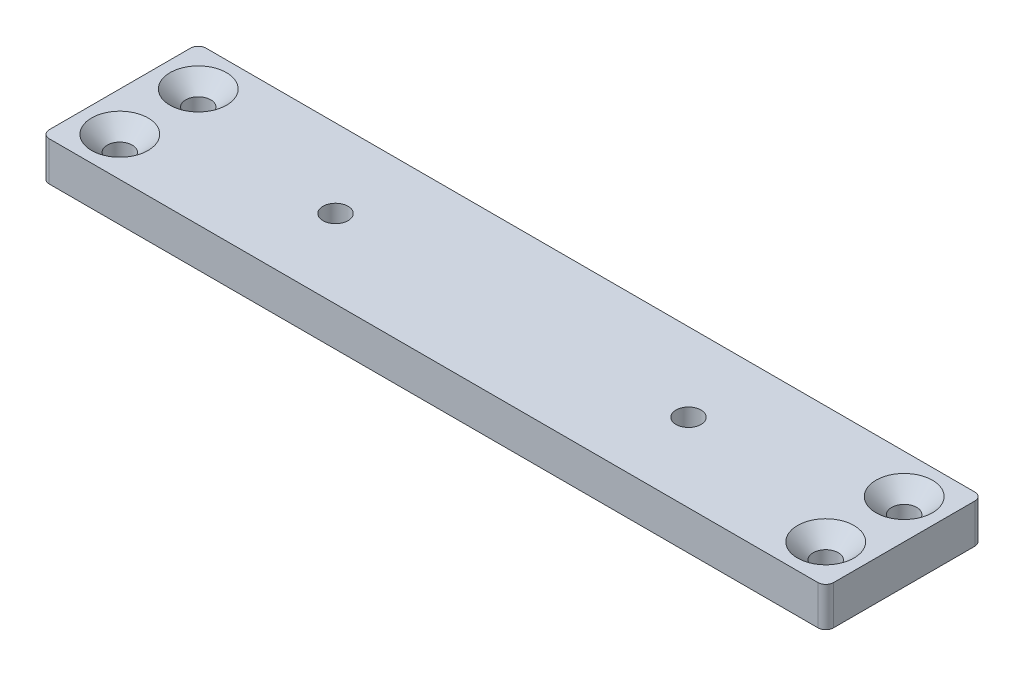
ISO-10303-21;
HEADER;
FILE_DESCRIPTION(('STEP AP214'),'2;1');
FILE_NAME('part.step','',(''),(''),'','','');
FILE_SCHEMA(('AUTOMOTIVE_DESIGN { 1 0 10303 214 1 1 1 1 }'));
ENDSEC;
DATA;
#1=APPLICATION_CONTEXT('core data for automotive mechanical design processes');
#2=APPLICATION_PROTOCOL_DEFINITION('international standard','automotive_design',2000,#1);
#3=PRODUCT_CONTEXT('',#1,'mechanical');
#4=PRODUCT('Part','Part','',(#3));
#5=PRODUCT_RELATED_PRODUCT_CATEGORY('part','',(#4));
#6=PRODUCT_DEFINITION_FORMATION('','',#4);
#7=PRODUCT_DEFINITION_CONTEXT('part definition',#1,'design');
#8=PRODUCT_DEFINITION('design','',#6,#7);
#9=PRODUCT_DEFINITION_SHAPE('','',#8);
#10=(LENGTH_UNIT() NAMED_UNIT(*) SI_UNIT(.MILLI.,.METRE.));
#11=(NAMED_UNIT(*) PLANE_ANGLE_UNIT() SI_UNIT($,.RADIAN.));
#12=(NAMED_UNIT(*) SI_UNIT($,.STERADIAN.) SOLID_ANGLE_UNIT());
#13=UNCERTAINTY_MEASURE_WITH_UNIT(LENGTH_MEASURE(1.E-05),#10,'distance_accuracy_value','');
#14=(GEOMETRIC_REPRESENTATION_CONTEXT(3) GLOBAL_UNCERTAINTY_ASSIGNED_CONTEXT((#13)) GLOBAL_UNIT_ASSIGNED_CONTEXT((#10,
#11,#12)) REPRESENTATION_CONTEXT('',''));
#15=CARTESIAN_POINT('',(0.,0.,0.));
#16=DIRECTION('',(0.,0.,1.));
#17=DIRECTION('',(1.,0.,0.));
#18=AXIS2_PLACEMENT_3D('',#15,#16,#17);
#19=CARTESIAN_POINT('',(-50.,0.,20.));
#20=DIRECTION('',(0.,0.,1.));
#21=DIRECTION('',(1.,0.,0.));
#22=AXIS2_PLACEMENT_3D('',#19,#20,#21);
#23=PLANE('',#22);
#24=DIRECTION('',(1.,0.,0.));
#25=VECTOR('',#24,1.);
#26=CARTESIAN_POINT('',(-50.,5.,20.));
#27=LINE('',#26,#25);
#28=CARTESIAN_POINT('',(-49.,5.,20.));
#29=VERTEX_POINT('',#28);
#30=CARTESIAN_POINT('',(49.,5.,20.));
#31=VERTEX_POINT('',#30);
#32=EDGE_CURVE('E113',#29,#31,#27,.T.);
#33=ORIENTED_EDGE('',*,*,#32,.F.);
#34=DIRECTION('',(0.,1.,0.));
#35=VECTOR('',#34,1.);
#36=CARTESIAN_POINT('',(-49.,0.,20.));
#37=LINE('',#36,#35);
#38=CARTESIAN_POINT('',(-49.,0.,20.));
#39=VERTEX_POINT('',#38);
#40=EDGE_CURVE('E182',#29,#39,#37,.F.);
#41=ORIENTED_EDGE('',*,*,#40,.T.);
#42=DIRECTION('',(1.,0.,0.));
#43=VECTOR('',#42,1.);
#44=CARTESIAN_POINT('',(-50.,0.,20.));
#45=LINE('',#44,#43);
#46=CARTESIAN_POINT('',(49.,0.,20.));
#47=VERTEX_POINT('',#46);
#48=EDGE_CURVE('E278',#39,#47,#45,.T.);
#49=ORIENTED_EDGE('',*,*,#48,.T.);
#50=DIRECTION('',(0.,1.,0.));
#51=VECTOR('',#50,1.);
#52=CARTESIAN_POINT('',(49.,0.,20.));
#53=LINE('',#52,#51);
#54=EDGE_CURVE('E179',#47,#31,#53,.T.);
#55=ORIENTED_EDGE('',*,*,#54,.T.);
#56=EDGE_LOOP('',(#33,#41,#49,#55));
#57=FACE_BOUND('',#56,.T.);
#58=ADVANCED_FACE('F40',(#57),#23,.T.);
#59=CARTESIAN_POINT('',(-50.,0.,0.));
#60=DIRECTION('',(-1.,0.,0.));
#61=DIRECTION('',(0.,0.,1.));
#62=AXIS2_PLACEMENT_3D('',#59,#60,#61);
#63=PLANE('',#62);
#64=DIRECTION('',(0.,0.,1.));
#65=VECTOR('',#64,1.);
#66=CARTESIAN_POINT('',(-50.,0.,0.));
#67=LINE('',#66,#65);
#68=CARTESIAN_POINT('',(-50.,0.,1.));
#69=VERTEX_POINT('',#68);
#70=CARTESIAN_POINT('',(-50.,0.,19.));
#71=VERTEX_POINT('',#70);
#72=EDGE_CURVE('E137',#69,#71,#67,.T.);
#73=ORIENTED_EDGE('',*,*,#72,.T.);
#74=DIRECTION('',(0.,1.,0.));
#75=VECTOR('',#74,1.);
#76=CARTESIAN_POINT('',(-50.,0.,19.));
#77=LINE('',#76,#75);
#78=CARTESIAN_POINT('',(-50.,5.,19.));
#79=VERTEX_POINT('',#78);
#80=EDGE_CURVE('E175',#71,#79,#77,.T.);
#81=ORIENTED_EDGE('',*,*,#80,.T.);
#82=DIRECTION('',(0.,0.,1.));
#83=VECTOR('',#82,1.);
#84=CARTESIAN_POINT('',(-50.,5.,0.));
#85=LINE('',#84,#83);
#86=CARTESIAN_POINT('',(-50.,5.,1.));
#87=VERTEX_POINT('',#86);
#88=EDGE_CURVE('E146',#87,#79,#85,.T.);
#89=ORIENTED_EDGE('',*,*,#88,.F.);
#90=DIRECTION('',(0.,1.,0.));
#91=VECTOR('',#90,1.);
#92=CARTESIAN_POINT('',(-50.,0.,1.));
#93=LINE('',#92,#91);
#94=EDGE_CURVE('E63',#87,#69,#93,.F.);
#95=ORIENTED_EDGE('',*,*,#94,.T.);
#96=EDGE_LOOP('',(#73,#81,#89,#95));
#97=FACE_BOUND('',#96,.T.);
#98=ADVANCED_FACE('F319',(#97),#63,.T.);
#99=CARTESIAN_POINT('',(50.,0.,0.));
#100=DIRECTION('',(0.,0.,-1.));
#101=DIRECTION('',(-1.,0.,0.));
#102=AXIS2_PLACEMENT_3D('',#99,#100,#101);
#103=PLANE('',#102);
#104=DIRECTION('',(-1.,0.,0.));
#105=VECTOR('',#104,1.);
#106=CARTESIAN_POINT('',(50.,5.,0.));
#107=LINE('',#106,#105);
#108=CARTESIAN_POINT('',(49.,5.,0.));
#109=VERTEX_POINT('',#108);
#110=CARTESIAN_POINT('',(-49.,5.,0.));
#111=VERTEX_POINT('',#110);
#112=EDGE_CURVE('E131',#109,#111,#107,.T.);
#113=ORIENTED_EDGE('',*,*,#112,.F.);
#114=DIRECTION('',(0.,1.,0.));
#115=VECTOR('',#114,1.);
#116=CARTESIAN_POINT('',(49.,0.,0.));
#117=LINE('',#116,#115);
#118=CARTESIAN_POINT('',(49.,0.,0.));
#119=VERTEX_POINT('',#118);
#120=EDGE_CURVE('E160',#109,#119,#117,.F.);
#121=ORIENTED_EDGE('',*,*,#120,.T.);
#122=DIRECTION('',(-1.,0.,0.));
#123=VECTOR('',#122,1.);
#124=CARTESIAN_POINT('',(50.,0.,0.));
#125=LINE('',#124,#123);
#126=CARTESIAN_POINT('',(-49.,0.,0.));
#127=VERTEX_POINT('',#126);
#128=EDGE_CURVE('E143',#119,#127,#125,.T.);
#129=ORIENTED_EDGE('',*,*,#128,.T.);
#130=DIRECTION('',(0.,1.,0.));
#131=VECTOR('',#130,1.);
#132=CARTESIAN_POINT('',(-49.,0.,0.));
#133=LINE('',#132,#131);
#134=EDGE_CURVE('E156',#127,#111,#133,.T.);
#135=ORIENTED_EDGE('',*,*,#134,.T.);
#136=EDGE_LOOP('',(#113,#121,#129,#135));
#137=FACE_BOUND('',#136,.T.);
#138=ADVANCED_FACE('F273',(#137),#103,.T.);
#139=CARTESIAN_POINT('',(50.,0.,20.));
#140=DIRECTION('',(1.,0.,0.));
#141=DIRECTION('',(0.,0.,-1.));
#142=AXIS2_PLACEMENT_3D('',#139,#140,#141);
#143=PLANE('',#142);
#144=DIRECTION('',(0.,0.,-1.));
#145=VECTOR('',#144,1.);
#146=CARTESIAN_POINT('',(50.,0.,20.));
#147=LINE('',#146,#145);
#148=CARTESIAN_POINT('',(50.,0.,19.));
#149=VERTEX_POINT('',#148);
#150=CARTESIAN_POINT('',(50.,0.,1.));
#151=VERTEX_POINT('',#150);
#152=EDGE_CURVE('E266',#149,#151,#147,.T.);
#153=ORIENTED_EDGE('',*,*,#152,.T.);
#154=DIRECTION('',(0.,1.,0.));
#155=VECTOR('',#154,1.);
#156=CARTESIAN_POINT('',(50.,0.,1.));
#157=LINE('',#156,#155);
#158=CARTESIAN_POINT('',(50.,5.,1.));
#159=VERTEX_POINT('',#158);
#160=EDGE_CURVE('E129',#151,#159,#157,.T.);
#161=ORIENTED_EDGE('',*,*,#160,.T.);
#162=DIRECTION('',(0.,0.,-1.));
#163=VECTOR('',#162,1.);
#164=CARTESIAN_POINT('',(50.,5.,20.));
#165=LINE('',#164,#163);
#166=CARTESIAN_POINT('',(50.,5.,19.));
#167=VERTEX_POINT('',#166);
#168=EDGE_CURVE('E111',#167,#159,#165,.T.);
#169=ORIENTED_EDGE('',*,*,#168,.F.);
#170=DIRECTION('',(0.,1.,0.));
#171=VECTOR('',#170,1.);
#172=CARTESIAN_POINT('',(50.,0.,19.));
#173=LINE('',#172,#171);
#174=EDGE_CURVE('E126',#167,#149,#173,.F.);
#175=ORIENTED_EDGE('',*,*,#174,.T.);
#176=EDGE_LOOP('',(#153,#161,#169,#175));
#177=FACE_BOUND('',#176,.T.);
#178=ADVANCED_FACE('F125',(#177),#143,.T.);
#179=CARTESIAN_POINT('',(0.,0.,0.));
#180=DIRECTION('',(0.,1.,0.));
#181=DIRECTION('',(0.,0.,1.));
#182=AXIS2_PLACEMENT_3D('',#179,#180,#181);
#183=PLANE('',#182);
#184=CARTESIAN_POINT('',(22.5,0.,9.99999999999999));
#185=DIRECTION('',(0.,1.,0.));
#186=DIRECTION('',(0.,0.,1.));
#187=AXIS2_PLACEMENT_3D('',#184,#185,#186);
#188=CIRCLE('',#187,3.59999999999998);
#189=CARTESIAN_POINT('',(22.5,0.,13.6));
#190=VERTEX_POINT('',#189);
#191=EDGE_CURVE('E221',#190,#190,#188,.T.);
#192=ORIENTED_EDGE('',*,*,#191,.T.);
#193=EDGE_LOOP('',(#192));
#194=FACE_BOUND('',#193,.T.);
#195=CARTESIAN_POINT('',(-22.5,0.,9.99999999999999));
#196=DIRECTION('',(0.,1.,0.));
#197=DIRECTION('',(0.,0.,1.));
#198=AXIS2_PLACEMENT_3D('',#195,#196,#197);
#199=CIRCLE('',#198,3.59999999999998);
#200=CARTESIAN_POINT('',(-22.5,0.,13.6));
#201=VERTEX_POINT('',#200);
#202=EDGE_CURVE('E217',#201,#201,#199,.T.);
#203=ORIENTED_EDGE('',*,*,#202,.T.);
#204=EDGE_LOOP('',(#203));
#205=FACE_BOUND('',#204,.T.);
#206=CARTESIAN_POINT('',(-45.,0.,15.));
#207=DIRECTION('',(0.,-1.,0.));
#208=DIRECTION('',(0.,0.,-1.));
#209=AXIS2_PLACEMENT_3D('',#206,#207,#208);
#210=CIRCLE('',#209,1.59999999999999);
#211=CARTESIAN_POINT('',(-45.,0.,13.4));
#212=VERTEX_POINT('',#211);
#213=EDGE_CURVE('E247',#212,#212,#210,.T.);
#214=ORIENTED_EDGE('',*,*,#213,.F.);
#215=EDGE_LOOP('',(#214));
#216=FACE_BOUND('',#215,.T.);
#217=CARTESIAN_POINT('',(-45.,0.,5.));
#218=DIRECTION('',(0.,-1.,0.));
#219=DIRECTION('',(0.,0.,-1.));
#220=AXIS2_PLACEMENT_3D('',#217,#218,#219);
#221=CIRCLE('',#220,1.59999999999999);
#222=CARTESIAN_POINT('',(-45.,0.,3.40000000000001));
#223=VERTEX_POINT('',#222);
#224=EDGE_CURVE('E251',#223,#223,#221,.T.);
#225=ORIENTED_EDGE('',*,*,#224,.F.);
#226=EDGE_LOOP('',(#225));
#227=FACE_BOUND('',#226,.T.);
#228=CARTESIAN_POINT('',(45.,0.,5.));
#229=DIRECTION('',(0.,-1.,0.));
#230=DIRECTION('',(0.,0.,-1.));
#231=AXIS2_PLACEMENT_3D('',#228,#229,#230);
#232=CIRCLE('',#231,1.59999999999999);
#233=CARTESIAN_POINT('',(45.,0.,3.40000000000001));
#234=VERTEX_POINT('',#233);
#235=EDGE_CURVE('E255',#234,#234,#232,.T.);
#236=ORIENTED_EDGE('',*,*,#235,.F.);
#237=EDGE_LOOP('',(#236));
#238=FACE_BOUND('',#237,.T.);
#239=CARTESIAN_POINT('',(45.,0.,15.));
#240=DIRECTION('',(0.,-1.,0.));
#241=DIRECTION('',(0.,0.,-1.));
#242=AXIS2_PLACEMENT_3D('',#239,#240,#241);
#243=CIRCLE('',#242,1.59999999999999);
#244=CARTESIAN_POINT('',(45.,0.,13.4));
#245=VERTEX_POINT('',#244);
#246=EDGE_CURVE('E258',#245,#245,#243,.T.);
#247=ORIENTED_EDGE('',*,*,#246,.F.);
#248=EDGE_LOOP('',(#247));
#249=FACE_BOUND('',#248,.T.);
#250=ORIENTED_EDGE('',*,*,#128,.F.);
#251=CARTESIAN_POINT('',(49.,0.,1.));
#252=DIRECTION('',(0.,1.,0.));
#253=DIRECTION('',(0.,0.,1.));
#254=AXIS2_PLACEMENT_3D('',#251,#252,#253);
#255=CIRCLE('',#254,1.);
#256=EDGE_CURVE('E170',#119,#151,#255,.F.);
#257=ORIENTED_EDGE('',*,*,#256,.T.);
#258=ORIENTED_EDGE('',*,*,#152,.F.);
#259=CARTESIAN_POINT('',(49.,0.,19.));
#260=DIRECTION('',(0.,1.,0.));
#261=DIRECTION('',(0.,0.,1.));
#262=AXIS2_PLACEMENT_3D('',#259,#260,#261);
#263=CIRCLE('',#262,1.);
#264=EDGE_CURVE('E135',#149,#47,#263,.F.);
#265=ORIENTED_EDGE('',*,*,#264,.T.);
#266=ORIENTED_EDGE('',*,*,#48,.F.);
#267=CARTESIAN_POINT('',(-49.,0.,19.));
#268=DIRECTION('',(0.,1.,0.));
#269=DIRECTION('',(0.,0.,1.));
#270=AXIS2_PLACEMENT_3D('',#267,#268,#269);
#271=CIRCLE('',#270,1.);
#272=EDGE_CURVE('E56',#39,#71,#271,.F.);
#273=ORIENTED_EDGE('',*,*,#272,.T.);
#274=ORIENTED_EDGE('',*,*,#72,.F.);
#275=CARTESIAN_POINT('',(-49.,0.,1.));
#276=DIRECTION('',(0.,1.,0.));
#277=DIRECTION('',(0.,0.,1.));
#278=AXIS2_PLACEMENT_3D('',#275,#276,#277);
#279=CIRCLE('',#278,1.);
#280=EDGE_CURVE('E163',#69,#127,#279,.F.);
#281=ORIENTED_EDGE('',*,*,#280,.T.);
#282=EDGE_LOOP('',(#250,#257,#258,#265,#266,#273,#274,#281));
#283=FACE_BOUND('',#282,.T.);
#284=ADVANCED_FACE('F238',(#194,#205,#216,#227,#238,#249,#283),#183,.F.);
#285=CARTESIAN_POINT('',(0.,5.,0.));
#286=DIRECTION('',(0.,1.,0.));
#287=DIRECTION('',(0.,0.,1.));
#288=AXIS2_PLACEMENT_3D('',#285,#286,#287);
#289=PLANE('',#288);
#290=CARTESIAN_POINT('',(-45.,5.,5.));
#291=DIRECTION('',(0.,1.,0.));
#292=DIRECTION('',(0.,0.,1.));
#293=AXIS2_PLACEMENT_3D('',#290,#291,#292);
#294=CIRCLE('',#293,3.59999999999998);
#295=CARTESIAN_POINT('',(-45.,5.,8.59999999999998));
#296=VERTEX_POINT('',#295);
#297=EDGE_CURVE('E197',#296,#296,#294,.F.);
#298=ORIENTED_EDGE('',*,*,#297,.T.);
#299=EDGE_LOOP('',(#298));
#300=FACE_BOUND('',#299,.T.);
#301=CARTESIAN_POINT('',(-45.,5.,15.));
#302=DIRECTION('',(0.,1.,0.));
#303=DIRECTION('',(0.,0.,1.));
#304=AXIS2_PLACEMENT_3D('',#301,#302,#303);
#305=CIRCLE('',#304,3.59999999999998);
#306=CARTESIAN_POINT('',(-45.,5.,18.6));
#307=VERTEX_POINT('',#306);
#308=EDGE_CURVE('E193',#307,#307,#305,.F.);
#309=ORIENTED_EDGE('',*,*,#308,.T.);
#310=EDGE_LOOP('',(#309));
#311=FACE_BOUND('',#310,.T.);
#312=CARTESIAN_POINT('',(45.,5.,5.));
#313=DIRECTION('',(0.,1.,0.));
#314=DIRECTION('',(0.,0.,1.));
#315=AXIS2_PLACEMENT_3D('',#312,#313,#314);
#316=CIRCLE('',#315,3.59999999999998);
#317=CARTESIAN_POINT('',(45.,5.,8.59999999999998));
#318=VERTEX_POINT('',#317);
#319=EDGE_CURVE('E189',#318,#318,#316,.F.);
#320=ORIENTED_EDGE('',*,*,#319,.T.);
#321=EDGE_LOOP('',(#320));
#322=FACE_BOUND('',#321,.T.);
#323=CARTESIAN_POINT('',(45.,5.,15.));
#324=DIRECTION('',(0.,1.,0.));
#325=DIRECTION('',(0.,0.,1.));
#326=AXIS2_PLACEMENT_3D('',#323,#324,#325);
#327=CIRCLE('',#326,3.59999999999998);
#328=CARTESIAN_POINT('',(45.,5.,18.6));
#329=VERTEX_POINT('',#328);
#330=EDGE_CURVE('E185',#329,#329,#327,.F.);
#331=ORIENTED_EDGE('',*,*,#330,.T.);
#332=EDGE_LOOP('',(#331));
#333=FACE_BOUND('',#332,.T.);
#334=CARTESIAN_POINT('',(22.5,5.,9.99999999999999));
#335=DIRECTION('',(0.,1.,0.));
#336=DIRECTION('',(0.,0.,1.));
#337=AXIS2_PLACEMENT_3D('',#334,#335,#336);
#338=CIRCLE('',#337,1.59999999999999);
#339=CARTESIAN_POINT('',(22.5,5.,11.6));
#340=VERTEX_POINT('',#339);
#341=EDGE_CURVE('E291',#340,#340,#338,.T.);
#342=ORIENTED_EDGE('',*,*,#341,.F.);
#343=EDGE_LOOP('',(#342));
#344=FACE_BOUND('',#343,.T.);
#345=CARTESIAN_POINT('',(-22.5,5.,9.99999999999999));
#346=DIRECTION('',(0.,1.,0.));
#347=DIRECTION('',(0.,0.,1.));
#348=AXIS2_PLACEMENT_3D('',#345,#346,#347);
#349=CIRCLE('',#348,1.59999999999999);
#350=CARTESIAN_POINT('',(-22.5,5.,11.6));
#351=VERTEX_POINT('',#350);
#352=EDGE_CURVE('E281',#351,#351,#349,.T.);
#353=ORIENTED_EDGE('',*,*,#352,.F.);
#354=EDGE_LOOP('',(#353));
#355=FACE_BOUND('',#354,.T.);
#356=ORIENTED_EDGE('',*,*,#168,.T.);
#357=CARTESIAN_POINT('',(49.,5.,1.));
#358=DIRECTION('',(0.,1.,0.));
#359=DIRECTION('',(0.,0.,1.));
#360=AXIS2_PLACEMENT_3D('',#357,#358,#359);
#361=CIRCLE('',#360,1.);
#362=EDGE_CURVE('E153',#159,#109,#361,.T.);
#363=ORIENTED_EDGE('',*,*,#362,.T.);
#364=ORIENTED_EDGE('',*,*,#112,.T.);
#365=CARTESIAN_POINT('',(-49.,5.,1.));
#366=DIRECTION('',(0.,1.,0.));
#367=DIRECTION('',(0.,0.,1.));
#368=AXIS2_PLACEMENT_3D('',#365,#366,#367);
#369=CIRCLE('',#368,1.);
#370=EDGE_CURVE('E120',#111,#87,#369,.T.);
#371=ORIENTED_EDGE('',*,*,#370,.T.);
#372=ORIENTED_EDGE('',*,*,#88,.T.);
#373=CARTESIAN_POINT('',(-49.,5.,19.));
#374=DIRECTION('',(0.,1.,0.));
#375=DIRECTION('',(0.,0.,1.));
#376=AXIS2_PLACEMENT_3D('',#373,#374,#375);
#377=CIRCLE('',#376,1.);
#378=EDGE_CURVE('E119',#79,#29,#377,.T.);
#379=ORIENTED_EDGE('',*,*,#378,.T.);
#380=ORIENTED_EDGE('',*,*,#32,.T.);
#381=CARTESIAN_POINT('',(49.,5.,19.));
#382=DIRECTION('',(0.,1.,0.));
#383=DIRECTION('',(0.,0.,1.));
#384=AXIS2_PLACEMENT_3D('',#381,#382,#383);
#385=CIRCLE('',#384,1.);
#386=EDGE_CURVE('E108',#31,#167,#385,.T.);
#387=ORIENTED_EDGE('',*,*,#386,.T.);
#388=EDGE_LOOP('',(#356,#363,#364,#371,#372,#379,#380,#387));
#389=FACE_BOUND('',#388,.T.);
#390=ADVANCED_FACE('F110',(#300,#311,#322,#333,#344,#355,#389),#289,.T.);
#391=CARTESIAN_POINT('',(-22.5,5.,9.99999999999999));
#392=DIRECTION('',(0.,1.,0.));
#393=DIRECTION('',(0.,0.,1.));
#394=AXIS2_PLACEMENT_3D('',#391,#392,#393);
#395=CYLINDRICAL_SURFACE('',#394,1.59999999999999);
#396=CARTESIAN_POINT('',(-22.5,2.00000000000001,9.99999999999999));
#397=DIRECTION('',(0.,1.,0.));
#398=DIRECTION('',(0.,0.,1.));
#399=AXIS2_PLACEMENT_3D('',#396,#397,#398);
#400=CIRCLE('',#399,1.59999999999999);
#401=CARTESIAN_POINT('',(-22.5,2.00000000000001,11.6));
#402=VERTEX_POINT('',#401);
#403=EDGE_CURVE('E11',#402,#402,#400,.F.);
#404=ORIENTED_EDGE('',*,*,#403,.T.);
#405=EDGE_LOOP('',(#404));
#406=FACE_BOUND('',#405,.T.);
#407=ORIENTED_EDGE('',*,*,#352,.T.);
#408=EDGE_LOOP('',(#407));
#409=FACE_BOUND('',#408,.T.);
#410=ADVANCED_FACE('F360',(#406,#409),#395,.F.);
#411=CARTESIAN_POINT('',(22.5,5.,9.99999999999999));
#412=DIRECTION('',(0.,1.,0.));
#413=DIRECTION('',(0.,0.,1.));
#414=AXIS2_PLACEMENT_3D('',#411,#412,#413);
#415=CYLINDRICAL_SURFACE('',#414,1.59999999999999);
#416=CARTESIAN_POINT('',(22.5,2.00000000000001,9.99999999999999));
#417=DIRECTION('',(0.,1.,0.));
#418=DIRECTION('',(0.,0.,1.));
#419=AXIS2_PLACEMENT_3D('',#416,#417,#418);
#420=CIRCLE('',#419,1.59999999999999);
#421=CARTESIAN_POINT('',(22.5,2.00000000000001,11.6));
#422=VERTEX_POINT('',#421);
#423=EDGE_CURVE('E49',#422,#422,#420,.F.);
#424=ORIENTED_EDGE('',*,*,#423,.T.);
#425=EDGE_LOOP('',(#424));
#426=FACE_BOUND('',#425,.T.);
#427=ORIENTED_EDGE('',*,*,#341,.T.);
#428=EDGE_LOOP('',(#427));
#429=FACE_BOUND('',#428,.T.);
#430=ADVANCED_FACE('F229',(#426,#429),#415,.F.);
#431=CARTESIAN_POINT('',(45.,0.,15.));
#432=DIRECTION('',(0.,-1.,0.));
#433=DIRECTION('',(0.,0.,-1.));
#434=AXIS2_PLACEMENT_3D('',#431,#432,#433);
#435=CYLINDRICAL_SURFACE('',#434,1.59999999999999);
#436=CARTESIAN_POINT('',(45.,2.99999999999999,15.));
#437=DIRECTION('',(0.,1.,0.));
#438=DIRECTION('',(0.,0.,1.));
#439=AXIS2_PLACEMENT_3D('',#436,#437,#438);
#440=CIRCLE('',#439,1.59999999999999);
#441=CARTESIAN_POINT('',(45.,2.99999999999999,16.6));
#442=VERTEX_POINT('',#441);
#443=EDGE_CURVE('E213',#442,#442,#440,.T.);
#444=ORIENTED_EDGE('',*,*,#443,.T.);
#445=EDGE_LOOP('',(#444));
#446=FACE_BOUND('',#445,.T.);
#447=ORIENTED_EDGE('',*,*,#246,.T.);
#448=EDGE_LOOP('',(#447));
#449=FACE_BOUND('',#448,.T.);
#450=ADVANCED_FACE('F373',(#446,#449),#435,.F.);
#451=CARTESIAN_POINT('',(45.,0.,5.));
#452=DIRECTION('',(0.,-1.,0.));
#453=DIRECTION('',(0.,0.,-1.));
#454=AXIS2_PLACEMENT_3D('',#451,#452,#453);
#455=CYLINDRICAL_SURFACE('',#454,1.59999999999999);
#456=CARTESIAN_POINT('',(45.,2.99999999999999,5.));
#457=DIRECTION('',(0.,1.,0.));
#458=DIRECTION('',(0.,0.,1.));
#459=AXIS2_PLACEMENT_3D('',#456,#457,#458);
#460=CIRCLE('',#459,1.59999999999999);
#461=CARTESIAN_POINT('',(45.,2.99999999999999,6.59999999999999));
#462=VERTEX_POINT('',#461);
#463=EDGE_CURVE('E209',#462,#462,#460,.T.);
#464=ORIENTED_EDGE('',*,*,#463,.T.);
#465=EDGE_LOOP('',(#464));
#466=FACE_BOUND('',#465,.T.);
#467=ORIENTED_EDGE('',*,*,#235,.T.);
#468=EDGE_LOOP('',(#467));
#469=FACE_BOUND('',#468,.T.);
#470=ADVANCED_FACE('F315',(#466,#469),#455,.F.);
#471=CARTESIAN_POINT('',(-45.,0.,5.));
#472=DIRECTION('',(0.,-1.,0.));
#473=DIRECTION('',(0.,0.,-1.));
#474=AXIS2_PLACEMENT_3D('',#471,#472,#473);
#475=CYLINDRICAL_SURFACE('',#474,1.59999999999999);
#476=CARTESIAN_POINT('',(-45.,2.99999999999999,5.));
#477=DIRECTION('',(0.,1.,0.));
#478=DIRECTION('',(0.,0.,1.));
#479=AXIS2_PLACEMENT_3D('',#476,#477,#478);
#480=CIRCLE('',#479,1.59999999999999);
#481=CARTESIAN_POINT('',(-45.,2.99999999999999,6.59999999999999));
#482=VERTEX_POINT('',#481);
#483=EDGE_CURVE('E201',#482,#482,#480,.T.);
#484=ORIENTED_EDGE('',*,*,#483,.T.);
#485=EDGE_LOOP('',(#484));
#486=FACE_BOUND('',#485,.T.);
#487=ORIENTED_EDGE('',*,*,#224,.T.);
#488=EDGE_LOOP('',(#487));
#489=FACE_BOUND('',#488,.T.);
#490=ADVANCED_FACE('F306',(#486,#489),#475,.F.);
#491=CARTESIAN_POINT('',(-45.,0.,15.));
#492=DIRECTION('',(0.,-1.,0.));
#493=DIRECTION('',(0.,0.,-1.));
#494=AXIS2_PLACEMENT_3D('',#491,#492,#493);
#495=CYLINDRICAL_SURFACE('',#494,1.59999999999999);
#496=CARTESIAN_POINT('',(-45.,2.99999999999999,15.));
#497=DIRECTION('',(0.,1.,0.));
#498=DIRECTION('',(0.,0.,1.));
#499=AXIS2_PLACEMENT_3D('',#496,#497,#498);
#500=CIRCLE('',#499,1.59999999999999);
#501=CARTESIAN_POINT('',(-45.,2.99999999999999,16.6));
#502=VERTEX_POINT('',#501);
#503=EDGE_CURVE('E205',#502,#502,#500,.T.);
#504=ORIENTED_EDGE('',*,*,#503,.T.);
#505=EDGE_LOOP('',(#504));
#506=FACE_BOUND('',#505,.T.);
#507=ORIENTED_EDGE('',*,*,#213,.T.);
#508=EDGE_LOOP('',(#507));
#509=FACE_BOUND('',#508,.T.);
#510=ADVANCED_FACE('F304',(#506,#509),#495,.F.);
#511=CARTESIAN_POINT('',(49.,0.,1.));
#512=DIRECTION('',(0.,1.,0.));
#513=DIRECTION('',(0.,0.,1.));
#514=AXIS2_PLACEMENT_3D('',#511,#512,#513);
#515=CYLINDRICAL_SURFACE('',#514,1.);
#516=ORIENTED_EDGE('',*,*,#256,.F.);
#517=ORIENTED_EDGE('',*,*,#120,.F.);
#518=ORIENTED_EDGE('',*,*,#362,.F.);
#519=ORIENTED_EDGE('',*,*,#160,.F.);
#520=EDGE_LOOP('',(#516,#517,#518,#519));
#521=FACE_BOUND('',#520,.T.);
#522=ADVANCED_FACE('F270',(#521),#515,.T.);
#523=CARTESIAN_POINT('',(-49.,0.,19.));
#524=DIRECTION('',(0.,1.,0.));
#525=DIRECTION('',(0.,0.,1.));
#526=AXIS2_PLACEMENT_3D('',#523,#524,#525);
#527=CYLINDRICAL_SURFACE('',#526,1.);
#528=ORIENTED_EDGE('',*,*,#272,.F.);
#529=ORIENTED_EDGE('',*,*,#40,.F.);
#530=ORIENTED_EDGE('',*,*,#378,.F.);
#531=ORIENTED_EDGE('',*,*,#80,.F.);
#532=EDGE_LOOP('',(#528,#529,#530,#531));
#533=FACE_BOUND('',#532,.T.);
#534=ADVANCED_FACE('F313',(#533),#527,.T.);
#535=CARTESIAN_POINT('',(49.,0.,19.));
#536=DIRECTION('',(0.,1.,0.));
#537=DIRECTION('',(0.,0.,1.));
#538=AXIS2_PLACEMENT_3D('',#535,#536,#537);
#539=CYLINDRICAL_SURFACE('',#538,1.);
#540=ORIENTED_EDGE('',*,*,#264,.F.);
#541=ORIENTED_EDGE('',*,*,#174,.F.);
#542=ORIENTED_EDGE('',*,*,#386,.F.);
#543=ORIENTED_EDGE('',*,*,#54,.F.);
#544=EDGE_LOOP('',(#540,#541,#542,#543));
#545=FACE_BOUND('',#544,.T.);
#546=ADVANCED_FACE('F134',(#545),#539,.T.);
#547=CARTESIAN_POINT('',(-49.,0.,1.));
#548=DIRECTION('',(0.,1.,0.));
#549=DIRECTION('',(0.,0.,1.));
#550=AXIS2_PLACEMENT_3D('',#547,#548,#549);
#551=CYLINDRICAL_SURFACE('',#550,1.);
#552=ORIENTED_EDGE('',*,*,#280,.F.);
#553=ORIENTED_EDGE('',*,*,#94,.F.);
#554=ORIENTED_EDGE('',*,*,#370,.F.);
#555=ORIENTED_EDGE('',*,*,#134,.F.);
#556=EDGE_LOOP('',(#552,#553,#554,#555));
#557=FACE_BOUND('',#556,.T.);
#558=ADVANCED_FACE('F334',(#557),#551,.T.);
#559=CARTESIAN_POINT('',(-45.,5.,5.));
#560=DIRECTION('',(0.,1.,0.));
#561=DIRECTION('',(0.,0.,1.));
#562=AXIS2_PLACEMENT_3D('',#559,#560,#561);
#563=CONICAL_SURFACE('',#562,3.59999999999998,0.785398163397443);
#564=ORIENTED_EDGE('',*,*,#483,.F.);
#565=EDGE_LOOP('',(#564));
#566=FACE_BOUND('',#565,.T.);
#567=ORIENTED_EDGE('',*,*,#297,.F.);
#568=EDGE_LOOP('',(#567));
#569=FACE_BOUND('',#568,.T.);
#570=ADVANCED_FACE('F337',(#566,#569),#563,.F.);
#571=CARTESIAN_POINT('',(-45.,5.,15.));
#572=DIRECTION('',(0.,1.,0.));
#573=DIRECTION('',(0.,0.,1.));
#574=AXIS2_PLACEMENT_3D('',#571,#572,#573);
#575=CONICAL_SURFACE('',#574,3.59999999999998,0.785398163397443);
#576=ORIENTED_EDGE('',*,*,#503,.F.);
#577=EDGE_LOOP('',(#576));
#578=FACE_BOUND('',#577,.T.);
#579=ORIENTED_EDGE('',*,*,#308,.F.);
#580=EDGE_LOOP('',(#579));
#581=FACE_BOUND('',#580,.T.);
#582=ADVANCED_FACE('F341',(#578,#581),#575,.F.);
#583=CARTESIAN_POINT('',(45.,5.,5.));
#584=DIRECTION('',(0.,1.,0.));
#585=DIRECTION('',(0.,0.,1.));
#586=AXIS2_PLACEMENT_3D('',#583,#584,#585);
#587=CONICAL_SURFACE('',#586,3.59999999999998,0.785398163397443);
#588=ORIENTED_EDGE('',*,*,#463,.F.);
#589=EDGE_LOOP('',(#588));
#590=FACE_BOUND('',#589,.T.);
#591=ORIENTED_EDGE('',*,*,#319,.F.);
#592=EDGE_LOOP('',(#591));
#593=FACE_BOUND('',#592,.T.);
#594=ADVANCED_FACE('F345',(#590,#593),#587,.F.);
#595=CARTESIAN_POINT('',(45.,5.,15.));
#596=DIRECTION('',(0.,1.,0.));
#597=DIRECTION('',(0.,0.,1.));
#598=AXIS2_PLACEMENT_3D('',#595,#596,#597);
#599=CONICAL_SURFACE('',#598,3.59999999999998,0.785398163397443);
#600=ORIENTED_EDGE('',*,*,#443,.F.);
#601=EDGE_LOOP('',(#600));
#602=FACE_BOUND('',#601,.T.);
#603=ORIENTED_EDGE('',*,*,#330,.F.);
#604=EDGE_LOOP('',(#603));
#605=FACE_BOUND('',#604,.T.);
#606=ADVANCED_FACE('F235',(#602,#605),#599,.F.);
#607=CARTESIAN_POINT('',(22.5,0.,9.99999999999999));
#608=DIRECTION('',(0.,-1.,0.));
#609=DIRECTION('',(0.,0.,-1.));
#610=AXIS2_PLACEMENT_3D('',#607,#608,#609);
#611=CONICAL_SURFACE('',#610,3.59999999999998,0.785398163397443);
#612=ORIENTED_EDGE('',*,*,#423,.F.);
#613=EDGE_LOOP('',(#612));
#614=FACE_BOUND('',#613,.T.);
#615=ORIENTED_EDGE('',*,*,#191,.F.);
#616=EDGE_LOOP('',(#615));
#617=FACE_BOUND('',#616,.T.);
#618=ADVANCED_FACE('F232',(#614,#617),#611,.F.);
#619=CARTESIAN_POINT('',(-22.5,0.,9.99999999999999));
#620=DIRECTION('',(0.,-1.,0.));
#621=DIRECTION('',(0.,0.,-1.));
#622=AXIS2_PLACEMENT_3D('',#619,#620,#621);
#623=CONICAL_SURFACE('',#622,3.59999999999998,0.785398163397443);
#624=ORIENTED_EDGE('',*,*,#403,.F.);
#625=EDGE_LOOP('',(#624));
#626=FACE_BOUND('',#625,.T.);
#627=ORIENTED_EDGE('',*,*,#202,.F.);
#628=EDGE_LOOP('',(#627));
#629=FACE_BOUND('',#628,.T.);
#630=ADVANCED_FACE('F42',(#626,#629),#623,.F.);
#631=CLOSED_SHELL('',(#58,#98,#138,#178,#284,#390,#410,#430,#450,#470,#490,#510,#522,#534,#546,
#558,#570,#582,#594,#606,#618,#630));
#632=MANIFOLD_SOLID_BREP('B2',#631);
#633=ADVANCED_BREP_SHAPE_REPRESENTATION('',(#18,#632),#14);
#634=SHAPE_DEFINITION_REPRESENTATION(#9,#633);
ENDSEC;
END-ISO-10303-21;
